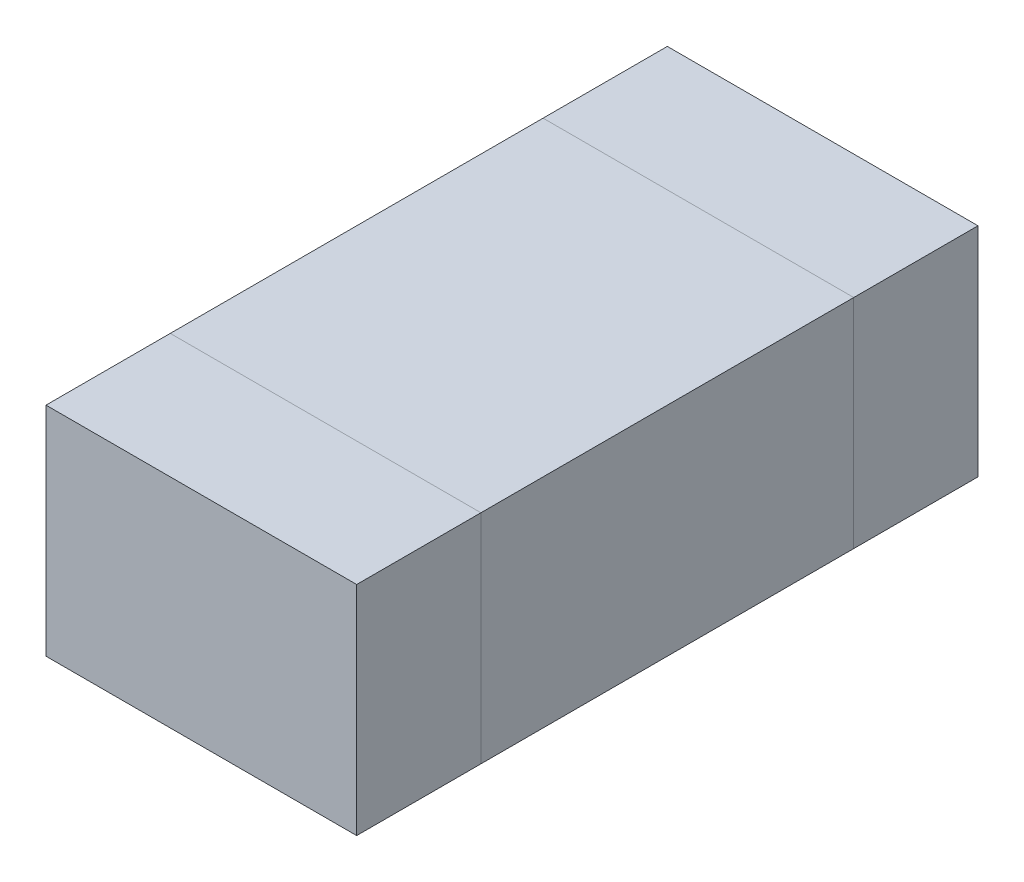
ISO-10303-21;
HEADER;
FILE_DESCRIPTION(('STEP AP214'),'2;1');
FILE_NAME('part.step','',(''),(''),'','','');
FILE_SCHEMA(('AUTOMOTIVE_DESIGN { 1 0 10303 214 1 1 1 1 }'));
ENDSEC;
DATA;
#1=APPLICATION_CONTEXT('core data for automotive mechanical design processes');
#2=APPLICATION_PROTOCOL_DEFINITION('international standard','automotive_design',2000,#1);
#3=PRODUCT_CONTEXT('',#1,'mechanical');
#4=PRODUCT('Part','Part','',(#3));
#5=PRODUCT_RELATED_PRODUCT_CATEGORY('part','',(#4));
#6=PRODUCT_DEFINITION_FORMATION('','',#4);
#7=PRODUCT_DEFINITION_CONTEXT('part definition',#1,'design');
#8=PRODUCT_DEFINITION('design','',#6,#7);
#9=PRODUCT_DEFINITION_SHAPE('','',#8);
#10=(LENGTH_UNIT() NAMED_UNIT(*) SI_UNIT(.MILLI.,.METRE.));
#11=(NAMED_UNIT(*) PLANE_ANGLE_UNIT() SI_UNIT($,.RADIAN.));
#12=(NAMED_UNIT(*) SI_UNIT($,.STERADIAN.) SOLID_ANGLE_UNIT());
#13=UNCERTAINTY_MEASURE_WITH_UNIT(LENGTH_MEASURE(1.E-05),#10,'distance_accuracy_value','');
#14=(GEOMETRIC_REPRESENTATION_CONTEXT(3) GLOBAL_UNCERTAINTY_ASSIGNED_CONTEXT((#13)) GLOBAL_UNIT_ASSIGNED_CONTEXT((#10,
#11,#12)) REPRESENTATION_CONTEXT('',''));
#15=CARTESIAN_POINT('',(0.,0.,0.));
#16=DIRECTION('',(0.,0.,1.));
#17=DIRECTION('',(1.,0.,0.));
#18=AXIS2_PLACEMENT_3D('',#15,#16,#17);
#19=CARTESIAN_POINT('',(-0.25,0.88851648071345,0.5));
#20=DIRECTION('',(0.,0.,1.));
#21=DIRECTION('',(1.,0.,0.));
#22=AXIS2_PLACEMENT_3D('',#19,#20,#21);
#23=PLANE('',#22);
#24=DIRECTION('',(0.,1.,0.));
#25=VECTOR('',#24,1.);
#26=CARTESIAN_POINT('',(-0.25,0.88851648071345,0.5));
#27=LINE('',#26,#25);
#28=CARTESIAN_POINT('',(-0.25,0.,0.5));
#29=VERTEX_POINT('',#28);
#30=CARTESIAN_POINT('',(-0.25,0.35,0.5));
#31=VERTEX_POINT('',#30);
#32=EDGE_CURVE('P0_E20',#29,#31,#27,.T.);
#33=ORIENTED_EDGE('',*,*,#32,.F.);
#34=DIRECTION('',(1.,0.,0.));
#35=VECTOR('',#34,1.);
#36=CARTESIAN_POINT('',(0.,0.,0.5));
#37=LINE('',#36,#35);
#38=CARTESIAN_POINT('',(0.25,0.,0.5));
#39=VERTEX_POINT('',#38);
#40=EDGE_CURVE('P0_E79',#29,#39,#37,.T.);
#41=ORIENTED_EDGE('',*,*,#40,.T.);
#42=DIRECTION('',(0.,1.,0.));
#43=VECTOR('',#42,1.);
#44=CARTESIAN_POINT('',(0.25,0.88851648071345,0.5));
#45=LINE('',#44,#43);
#46=CARTESIAN_POINT('',(0.25,0.35,0.5));
#47=VERTEX_POINT('',#46);
#48=EDGE_CURVE('P0_E68',#47,#39,#45,.F.);
#49=ORIENTED_EDGE('',*,*,#48,.F.);
#50=DIRECTION('',(1.,0.,0.));
#51=VECTOR('',#50,1.);
#52=CARTESIAN_POINT('',(0.,0.35,0.5));
#53=LINE('',#52,#51);
#54=EDGE_CURVE('P0_E56',#31,#47,#53,.T.);
#55=ORIENTED_EDGE('',*,*,#54,.F.);
#56=EDGE_LOOP('',(#33,#41,#49,#55));
#57=FACE_BOUND('',#56,.T.);
#58=ADVANCED_FACE('P0_F17',(#57),#23,.T.);
#59=CARTESIAN_POINT('',(-0.25,0.88851648071345,0.3));
#60=DIRECTION('',(-1.,0.,0.));
#61=DIRECTION('',(0.,0.,1.));
#62=AXIS2_PLACEMENT_3D('',#59,#60,#61);
#63=PLANE('',#62);
#64=DIRECTION('',(0.,1.,0.));
#65=VECTOR('',#64,1.);
#66=CARTESIAN_POINT('',(-0.25,0.88851648071345,0.3));
#67=LINE('',#66,#65);
#68=CARTESIAN_POINT('',(-0.25,0.,0.3));
#69=VERTEX_POINT('',#68);
#70=CARTESIAN_POINT('',(-0.25,0.35,0.3));
#71=VERTEX_POINT('',#70);
#72=EDGE_CURVE('P0_E83',#69,#71,#67,.T.);
#73=ORIENTED_EDGE('',*,*,#72,.F.);
#74=DIRECTION('',(0.,0.,1.));
#75=VECTOR('',#74,1.);
#76=CARTESIAN_POINT('',(-0.25,0.,0.));
#77=LINE('',#76,#75);
#78=EDGE_CURVE('P0_E65',#69,#29,#77,.T.);
#79=ORIENTED_EDGE('',*,*,#78,.T.);
#80=ORIENTED_EDGE('',*,*,#32,.T.);
#81=DIRECTION('',(0.,0.,1.));
#82=VECTOR('',#81,1.);
#83=CARTESIAN_POINT('',(-0.25,0.35,0.));
#84=LINE('',#83,#82);
#85=EDGE_CURVE('P0_E62',#71,#31,#84,.T.);
#86=ORIENTED_EDGE('',*,*,#85,.F.);
#87=EDGE_LOOP('',(#73,#79,#80,#86));
#88=FACE_BOUND('',#87,.T.);
#89=ADVANCED_FACE('P0_F61',(#88),#63,.T.);
#90=CARTESIAN_POINT('',(0.,0.35,0.));
#91=DIRECTION('',(0.,1.,0.));
#92=DIRECTION('',(0.,0.,1.));
#93=AXIS2_PLACEMENT_3D('',#90,#91,#92);
#94=PLANE('',#93);
#95=DIRECTION('',(0.,0.,-1.));
#96=VECTOR('',#95,1.);
#97=CARTESIAN_POINT('',(0.25,0.35,0.3));
#98=LINE('',#97,#96);
#99=CARTESIAN_POINT('',(0.25,0.35,0.3));
#100=VERTEX_POINT('',#99);
#101=EDGE_CURVE('P0_E70',#100,#47,#98,.F.);
#102=ORIENTED_EDGE('',*,*,#101,.F.);
#103=DIRECTION('',(-1.,0.,0.));
#104=VECTOR('',#103,1.);
#105=CARTESIAN_POINT('',(-0.25,0.35,0.3));
#106=LINE('',#105,#104);
#107=EDGE_CURVE('P0_E74',#71,#100,#106,.F.);
#108=ORIENTED_EDGE('',*,*,#107,.F.);
#109=ORIENTED_EDGE('',*,*,#85,.T.);
#110=ORIENTED_EDGE('',*,*,#54,.T.);
#111=EDGE_LOOP('',(#102,#108,#109,#110));
#112=FACE_BOUND('',#111,.T.);
#113=ADVANCED_FACE('P0_F72',(#112),#94,.T.);
#114=CARTESIAN_POINT('',(0.25,0.88851648071345,0.3));
#115=DIRECTION('',(1.,0.,0.));
#116=DIRECTION('',(0.,0.,-1.));
#117=AXIS2_PLACEMENT_3D('',#114,#115,#116);
#118=PLANE('',#117);
#119=ORIENTED_EDGE('',*,*,#48,.T.);
#120=DIRECTION('',(0.,0.,1.));
#121=VECTOR('',#120,1.);
#122=CARTESIAN_POINT('',(0.25,0.,0.));
#123=LINE('',#122,#121);
#124=CARTESIAN_POINT('',(0.25,0.,0.3));
#125=VERTEX_POINT('',#124);
#126=EDGE_CURVE('P0_E35',#39,#125,#123,.F.);
#127=ORIENTED_EDGE('',*,*,#126,.T.);
#128=DIRECTION('',(0.,1.,0.));
#129=VECTOR('',#128,1.);
#130=CARTESIAN_POINT('',(0.25,0.88851648071345,0.3));
#131=LINE('',#130,#129);
#132=EDGE_CURVE('P0_E26',#100,#125,#131,.F.);
#133=ORIENTED_EDGE('',*,*,#132,.F.);
#134=ORIENTED_EDGE('',*,*,#101,.T.);
#135=EDGE_LOOP('',(#119,#127,#133,#134));
#136=FACE_BOUND('',#135,.T.);
#137=ADVANCED_FACE('P0_F89',(#136),#118,.T.);
#138=CARTESIAN_POINT('',(0.,0.,0.));
#139=DIRECTION('',(0.,1.,0.));
#140=DIRECTION('',(0.,0.,1.));
#141=AXIS2_PLACEMENT_3D('',#138,#139,#140);
#142=PLANE('',#141);
#143=DIRECTION('',(-1.,0.,0.));
#144=VECTOR('',#143,1.);
#145=CARTESIAN_POINT('',(-0.25,0.,0.3));
#146=LINE('',#145,#144);
#147=EDGE_CURVE('P0_E11',#125,#69,#146,.T.);
#148=ORIENTED_EDGE('',*,*,#147,.F.);
#149=ORIENTED_EDGE('',*,*,#126,.F.);
#150=ORIENTED_EDGE('',*,*,#40,.F.);
#151=ORIENTED_EDGE('',*,*,#78,.F.);
#152=EDGE_LOOP('',(#148,#149,#150,#151));
#153=FACE_BOUND('',#152,.T.);
#154=ADVANCED_FACE('P0_F91',(#153),#142,.F.);
#155=CARTESIAN_POINT('',(-0.25,0.88851648071345,0.3));
#156=DIRECTION('',(0.,0.,-1.));
#157=DIRECTION('',(-1.,0.,0.));
#158=AXIS2_PLACEMENT_3D('',#155,#156,#157);
#159=PLANE('',#158);
#160=ORIENTED_EDGE('',*,*,#132,.T.);
#161=ORIENTED_EDGE('',*,*,#147,.T.);
#162=ORIENTED_EDGE('',*,*,#72,.T.);
#163=ORIENTED_EDGE('',*,*,#107,.T.);
#164=EDGE_LOOP('',(#160,#161,#162,#163));
#165=FACE_BOUND('',#164,.T.);
#166=ADVANCED_FACE('P0_F88',(#165),#159,.T.);
#167=CLOSED_SHELL('',(#58,#89,#113,#137,#154,#166));
#168=MANIFOLD_SOLID_BREP('P0_B1',#167);
#169=CARTESIAN_POINT('',(-0.25,0.888516480713451,-0.3));
#170=DIRECTION('',(0.,0.,1.));
#171=DIRECTION('',(1.,0.,0.));
#172=AXIS2_PLACEMENT_3D('',#169,#170,#171);
#173=PLANE('',#172);
#174=DIRECTION('',(0.,1.,0.));
#175=VECTOR('',#174,1.);
#176=CARTESIAN_POINT('',(-0.25,0.888516480713451,-0.3));
#177=LINE('',#176,#175);
#178=CARTESIAN_POINT('',(-0.25,0.,-0.3));
#179=VERTEX_POINT('',#178);
#180=CARTESIAN_POINT('',(-0.25,0.35,-0.3));
#181=VERTEX_POINT('',#180);
#182=EDGE_CURVE('P1_E20',#179,#181,#177,.T.);
#183=ORIENTED_EDGE('',*,*,#182,.F.);
#184=DIRECTION('',(1.,0.,0.));
#185=VECTOR('',#184,1.);
#186=CARTESIAN_POINT('',(0.,0.,-0.3));
#187=LINE('',#186,#185);
#188=CARTESIAN_POINT('',(0.25,0.,-0.3));
#189=VERTEX_POINT('',#188);
#190=EDGE_CURVE('P1_E81',#189,#179,#187,.F.);
#191=ORIENTED_EDGE('',*,*,#190,.F.);
#192=DIRECTION('',(0.,1.,0.));
#193=VECTOR('',#192,1.);
#194=CARTESIAN_POINT('',(0.25,0.888516480713451,-0.3));
#195=LINE('',#194,#193);
#196=CARTESIAN_POINT('',(0.25,0.35,-0.3));
#197=VERTEX_POINT('',#196);
#198=EDGE_CURVE('P1_E68',#197,#189,#195,.F.);
#199=ORIENTED_EDGE('',*,*,#198,.F.);
#200=DIRECTION('',(1.,0.,0.));
#201=VECTOR('',#200,1.);
#202=CARTESIAN_POINT('',(0.,0.35,-0.3));
#203=LINE('',#202,#201);
#204=EDGE_CURVE('P1_E55',#181,#197,#203,.T.);
#205=ORIENTED_EDGE('',*,*,#204,.F.);
#206=EDGE_LOOP('',(#183,#191,#199,#205));
#207=FACE_BOUND('',#206,.T.);
#208=ADVANCED_FACE('P1_F17',(#207),#173,.T.);
#209=CARTESIAN_POINT('',(-0.25,0.888516480713451,-0.3));
#210=DIRECTION('',(-1.,0.,0.));
#211=DIRECTION('',(0.,0.,1.));
#212=AXIS2_PLACEMENT_3D('',#209,#210,#211);
#213=PLANE('',#212);
#214=DIRECTION('',(0.,1.,0.));
#215=VECTOR('',#214,1.);
#216=CARTESIAN_POINT('',(-0.25,0.888516480713451,-0.5));
#217=LINE('',#216,#215);
#218=CARTESIAN_POINT('',(-0.25,0.,-0.5));
#219=VERTEX_POINT('',#218);
#220=CARTESIAN_POINT('',(-0.25,0.35,-0.5));
#221=VERTEX_POINT('',#220);
#222=EDGE_CURVE('P1_E83',#219,#221,#217,.T.);
#223=ORIENTED_EDGE('',*,*,#222,.F.);
#224=DIRECTION('',(0.,0.,-1.));
#225=VECTOR('',#224,1.);
#226=CARTESIAN_POINT('',(-0.25,0.,0.));
#227=LINE('',#226,#225);
#228=EDGE_CURVE('P1_E64',#179,#219,#227,.T.);
#229=ORIENTED_EDGE('',*,*,#228,.F.);
#230=ORIENTED_EDGE('',*,*,#182,.T.);
#231=DIRECTION('',(0.,0.,1.));
#232=VECTOR('',#231,1.);
#233=CARTESIAN_POINT('',(-0.25,0.35,0.));
#234=LINE('',#233,#232);
#235=EDGE_CURVE('P1_E61',#221,#181,#234,.T.);
#236=ORIENTED_EDGE('',*,*,#235,.F.);
#237=EDGE_LOOP('',(#223,#229,#230,#236));
#238=FACE_BOUND('',#237,.T.);
#239=ADVANCED_FACE('P1_F60',(#238),#213,.T.);
#240=CARTESIAN_POINT('',(0.,0.35,0.));
#241=DIRECTION('',(0.,1.,0.));
#242=DIRECTION('',(0.,0.,1.));
#243=AXIS2_PLACEMENT_3D('',#240,#241,#242);
#244=PLANE('',#243);
#245=DIRECTION('',(0.,0.,-1.));
#246=VECTOR('',#245,1.);
#247=CARTESIAN_POINT('',(0.25,0.35,-0.3));
#248=LINE('',#247,#246);
#249=CARTESIAN_POINT('',(0.25,0.35,-0.5));
#250=VERTEX_POINT('',#249);
#251=EDGE_CURVE('P1_E70',#250,#197,#248,.F.);
#252=ORIENTED_EDGE('',*,*,#251,.F.);
#253=DIRECTION('',(-1.,0.,0.));
#254=VECTOR('',#253,1.);
#255=CARTESIAN_POINT('',(-0.25,0.35,-0.5));
#256=LINE('',#255,#254);
#257=EDGE_CURVE('P1_E74',#221,#250,#256,.F.);
#258=ORIENTED_EDGE('',*,*,#257,.F.);
#259=ORIENTED_EDGE('',*,*,#235,.T.);
#260=ORIENTED_EDGE('',*,*,#204,.T.);
#261=EDGE_LOOP('',(#252,#258,#259,#260));
#262=FACE_BOUND('',#261,.T.);
#263=ADVANCED_FACE('P1_F72',(#262),#244,.T.);
#264=CARTESIAN_POINT('',(0.25,0.888516480713451,-0.3));
#265=DIRECTION('',(1.,0.,0.));
#266=DIRECTION('',(0.,0.,-1.));
#267=AXIS2_PLACEMENT_3D('',#264,#265,#266);
#268=PLANE('',#267);
#269=ORIENTED_EDGE('',*,*,#198,.T.);
#270=DIRECTION('',(0.,0.,-1.));
#271=VECTOR('',#270,1.);
#272=CARTESIAN_POINT('',(0.25,0.,0.));
#273=LINE('',#272,#271);
#274=CARTESIAN_POINT('',(0.25,0.,-0.5));
#275=VERTEX_POINT('',#274);
#276=EDGE_CURVE('P1_E35',#275,#189,#273,.F.);
#277=ORIENTED_EDGE('',*,*,#276,.F.);
#278=DIRECTION('',(0.,1.,0.));
#279=VECTOR('',#278,1.);
#280=CARTESIAN_POINT('',(0.25,0.888516480713451,-0.5));
#281=LINE('',#280,#279);
#282=EDGE_CURVE('P1_E26',#250,#275,#281,.F.);
#283=ORIENTED_EDGE('',*,*,#282,.F.);
#284=ORIENTED_EDGE('',*,*,#251,.T.);
#285=EDGE_LOOP('',(#269,#277,#283,#284));
#286=FACE_BOUND('',#285,.T.);
#287=ADVANCED_FACE('P1_F89',(#286),#268,.T.);
#288=CARTESIAN_POINT('',(0.,0.,0.));
#289=DIRECTION('',(0.,-1.,0.));
#290=DIRECTION('',(0.,0.,-1.));
#291=AXIS2_PLACEMENT_3D('',#288,#289,#290);
#292=PLANE('',#291);
#293=ORIENTED_EDGE('',*,*,#276,.T.);
#294=ORIENTED_EDGE('',*,*,#190,.T.);
#295=ORIENTED_EDGE('',*,*,#228,.T.);
#296=DIRECTION('',(-1.,0.,0.));
#297=VECTOR('',#296,1.);
#298=CARTESIAN_POINT('',(-0.25,0.,-0.5));
#299=LINE('',#298,#297);
#300=EDGE_CURVE('P1_E11',#275,#219,#299,.T.);
#301=ORIENTED_EDGE('',*,*,#300,.F.);
#302=EDGE_LOOP('',(#293,#294,#295,#301));
#303=FACE_BOUND('',#302,.T.);
#304=ADVANCED_FACE('P1_F91',(#303),#292,.T.);
#305=CARTESIAN_POINT('',(-0.25,0.888516480713451,-0.5));
#306=DIRECTION('',(0.,0.,-1.));
#307=DIRECTION('',(-1.,0.,0.));
#308=AXIS2_PLACEMENT_3D('',#305,#306,#307);
#309=PLANE('',#308);
#310=ORIENTED_EDGE('',*,*,#282,.T.);
#311=ORIENTED_EDGE('',*,*,#300,.T.);
#312=ORIENTED_EDGE('',*,*,#222,.T.);
#313=ORIENTED_EDGE('',*,*,#257,.T.);
#314=EDGE_LOOP('',(#310,#311,#312,#313));
#315=FACE_BOUND('',#314,.T.);
#316=ADVANCED_FACE('P1_F88',(#315),#309,.T.);
#317=CLOSED_SHELL('',(#208,#239,#263,#287,#304,#316));
#318=MANIFOLD_SOLID_BREP('P1_B1',#317);
#319=CARTESIAN_POINT('',(0.,0.,0.));
#320=DIRECTION('',(0.,1.,0.));
#321=DIRECTION('',(0.,0.,1.));
#322=AXIS2_PLACEMENT_3D('',#319,#320,#321);
#323=PLANE('',#322);
#324=DIRECTION('',(-1.,0.,0.));
#325=VECTOR('',#324,1.);
#326=CARTESIAN_POINT('',(-0.25,0.,0.3));
#327=LINE('',#326,#325);
#328=CARTESIAN_POINT('',(0.25,0.,0.3));
#329=VERTEX_POINT('',#328);
#330=CARTESIAN_POINT('',(-0.25,0.,0.3));
#331=VERTEX_POINT('',#330);
#332=EDGE_CURVE('P2_E81',#329,#331,#327,.T.);
#333=ORIENTED_EDGE('',*,*,#332,.T.);
#334=DIRECTION('',(0.,0.,-1.));
#335=VECTOR('',#334,1.);
#336=CARTESIAN_POINT('',(-0.25,0.,-0.3));
#337=LINE('',#336,#335);
#338=CARTESIAN_POINT('',(-0.25,0.,-0.3));
#339=VERTEX_POINT('',#338);
#340=EDGE_CURVE('P2_E68',#331,#339,#337,.T.);
#341=ORIENTED_EDGE('',*,*,#340,.T.);
#342=DIRECTION('',(1.,0.,0.));
#343=VECTOR('',#342,1.);
#344=CARTESIAN_POINT('',(-0.25,0.,-0.3));
#345=LINE('',#344,#343);
#346=CARTESIAN_POINT('',(0.25,0.,-0.3));
#347=VERTEX_POINT('',#346);
#348=EDGE_CURVE('P2_E55',#339,#347,#345,.T.);
#349=ORIENTED_EDGE('',*,*,#348,.T.);
#350=DIRECTION('',(0.,0.,1.));
#351=VECTOR('',#350,1.);
#352=CARTESIAN_POINT('',(0.25,0.,-0.3));
#353=LINE('',#352,#351);
#354=EDGE_CURVE('P2_E20',#347,#329,#353,.T.);
#355=ORIENTED_EDGE('',*,*,#354,.T.);
#356=EDGE_LOOP('',(#333,#341,#349,#355));
#357=FACE_BOUND('',#356,.T.);
#358=ADVANCED_FACE('P2_F17',(#357),#323,.F.);
#359=CARTESIAN_POINT('',(0.25,0.35,-0.3));
#360=DIRECTION('',(-1.,0.,0.));
#361=DIRECTION('',(0.,0.,1.));
#362=AXIS2_PLACEMENT_3D('',#359,#360,#361);
#363=PLANE('',#362);
#364=DIRECTION('',(0.,1.,0.));
#365=VECTOR('',#364,1.);
#366=CARTESIAN_POINT('',(0.25,0.35,-0.3));
#367=LINE('',#366,#365);
#368=CARTESIAN_POINT('',(0.25,0.35,-0.3));
#369=VERTEX_POINT('',#368);
#370=EDGE_CURVE('P2_E61',#347,#369,#367,.T.);
#371=ORIENTED_EDGE('',*,*,#370,.T.);
#372=DIRECTION('',(0.,0.,1.));
#373=VECTOR('',#372,1.);
#374=CARTESIAN_POINT('',(0.25,0.35,0.));
#375=LINE('',#374,#373);
#376=CARTESIAN_POINT('',(0.25,0.35,0.3));
#377=VERTEX_POINT('',#376);
#378=EDGE_CURVE('P2_E83',#377,#369,#375,.F.);
#379=ORIENTED_EDGE('',*,*,#378,.F.);
#380=DIRECTION('',(0.,1.,0.));
#381=VECTOR('',#380,1.);
#382=CARTESIAN_POINT('',(0.25,0.35,0.3));
#383=LINE('',#382,#381);
#384=EDGE_CURVE('P2_E64',#377,#329,#383,.F.);
#385=ORIENTED_EDGE('',*,*,#384,.T.);
#386=ORIENTED_EDGE('',*,*,#354,.F.);
#387=EDGE_LOOP('',(#371,#379,#385,#386));
#388=FACE_BOUND('',#387,.T.);
#389=ADVANCED_FACE('P2_F60',(#388),#363,.F.);
#390=CARTESIAN_POINT('',(-0.25,0.35,-0.3));
#391=DIRECTION('',(0.,0.,1.));
#392=DIRECTION('',(1.,0.,0.));
#393=AXIS2_PLACEMENT_3D('',#390,#391,#392);
#394=PLANE('',#393);
#395=DIRECTION('',(0.,1.,0.));
#396=VECTOR('',#395,1.);
#397=CARTESIAN_POINT('',(-0.25,0.35,-0.3));
#398=LINE('',#397,#396);
#399=CARTESIAN_POINT('',(-0.25,0.35,-0.3));
#400=VERTEX_POINT('',#399);
#401=EDGE_CURVE('P2_E70',#339,#400,#398,.T.);
#402=ORIENTED_EDGE('',*,*,#401,.T.);
#403=DIRECTION('',(1.,0.,0.));
#404=VECTOR('',#403,1.);
#405=CARTESIAN_POINT('',(0.,0.35,-0.3));
#406=LINE('',#405,#404);
#407=EDGE_CURVE('P2_E74',#369,#400,#406,.F.);
#408=ORIENTED_EDGE('',*,*,#407,.F.);
#409=ORIENTED_EDGE('',*,*,#370,.F.);
#410=ORIENTED_EDGE('',*,*,#348,.F.);
#411=EDGE_LOOP('',(#402,#408,#409,#410));
#412=FACE_BOUND('',#411,.T.);
#413=ADVANCED_FACE('P2_F72',(#412),#394,.F.);
#414=CARTESIAN_POINT('',(-0.25,0.35,-0.3));
#415=DIRECTION('',(1.,0.,0.));
#416=DIRECTION('',(0.,0.,-1.));
#417=AXIS2_PLACEMENT_3D('',#414,#415,#416);
#418=PLANE('',#417);
#419=DIRECTION('',(0.,1.,0.));
#420=VECTOR('',#419,1.);
#421=CARTESIAN_POINT('',(-0.25,0.35,0.3));
#422=LINE('',#421,#420);
#423=CARTESIAN_POINT('',(-0.25,0.35,0.3));
#424=VERTEX_POINT('',#423);
#425=EDGE_CURVE('P2_E35',#331,#424,#422,.T.);
#426=ORIENTED_EDGE('',*,*,#425,.T.);
#427=DIRECTION('',(0.,0.,1.));
#428=VECTOR('',#427,1.);
#429=CARTESIAN_POINT('',(-0.25,0.35,0.));
#430=LINE('',#429,#428);
#431=EDGE_CURVE('P2_E26',#400,#424,#430,.T.);
#432=ORIENTED_EDGE('',*,*,#431,.F.);
#433=ORIENTED_EDGE('',*,*,#401,.F.);
#434=ORIENTED_EDGE('',*,*,#340,.F.);
#435=EDGE_LOOP('',(#426,#432,#433,#434));
#436=FACE_BOUND('',#435,.T.);
#437=ADVANCED_FACE('P2_F89',(#436),#418,.F.);
#438=CARTESIAN_POINT('',(-0.25,0.35,0.3));
#439=DIRECTION('',(0.,0.,-1.));
#440=DIRECTION('',(-1.,0.,0.));
#441=AXIS2_PLACEMENT_3D('',#438,#439,#440);
#442=PLANE('',#441);
#443=ORIENTED_EDGE('',*,*,#384,.F.);
#444=DIRECTION('',(1.,0.,0.));
#445=VECTOR('',#444,1.);
#446=CARTESIAN_POINT('',(0.,0.35,0.3));
#447=LINE('',#446,#445);
#448=EDGE_CURVE('P2_E11',#424,#377,#447,.T.);
#449=ORIENTED_EDGE('',*,*,#448,.F.);
#450=ORIENTED_EDGE('',*,*,#425,.F.);
#451=ORIENTED_EDGE('',*,*,#332,.F.);
#452=EDGE_LOOP('',(#443,#449,#450,#451));
#453=FACE_BOUND('',#452,.T.);
#454=ADVANCED_FACE('P2_F91',(#453),#442,.F.);
#455=CARTESIAN_POINT('',(0.,0.35,0.));
#456=DIRECTION('',(0.,1.,0.));
#457=DIRECTION('',(0.,0.,1.));
#458=AXIS2_PLACEMENT_3D('',#455,#456,#457);
#459=PLANE('',#458);
#460=ORIENTED_EDGE('',*,*,#431,.T.);
#461=ORIENTED_EDGE('',*,*,#448,.T.);
#462=ORIENTED_EDGE('',*,*,#378,.T.);
#463=ORIENTED_EDGE('',*,*,#407,.T.);
#464=EDGE_LOOP('',(#460,#461,#462,#463));
#465=FACE_BOUND('',#464,.T.);
#466=ADVANCED_FACE('P2_F88',(#465),#459,.T.);
#467=CLOSED_SHELL('',(#358,#389,#413,#437,#454,#466));
#468=MANIFOLD_SOLID_BREP('P2_B1',#467);
#469=ADVANCED_BREP_SHAPE_REPRESENTATION('',(#18,#168,#318,#468),#14);
#470=SHAPE_DEFINITION_REPRESENTATION(#9,#469);
ENDSEC;
END-ISO-10303-21;
